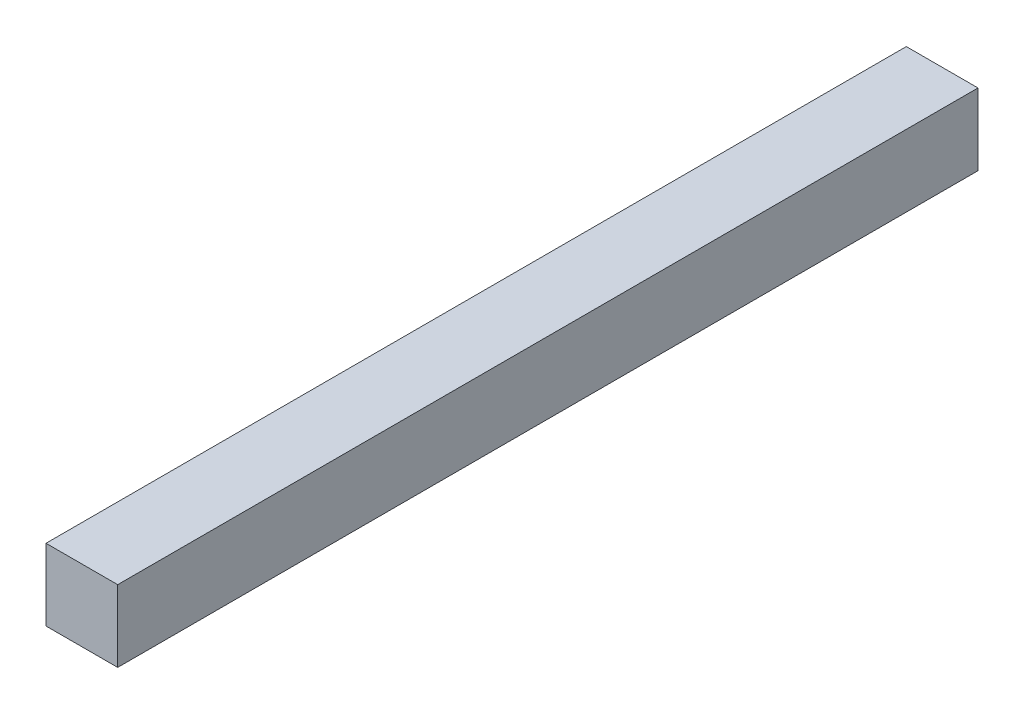
ISO-10303-21;
HEADER;
FILE_DESCRIPTION(('STEP AP214'),'2;1');
FILE_NAME('part.step','',(''),(''),'','','');
FILE_SCHEMA(('AUTOMOTIVE_DESIGN { 1 0 10303 214 1 1 1 1 }'));
ENDSEC;
DATA;
#1=APPLICATION_CONTEXT('core data for automotive mechanical design processes');
#2=APPLICATION_PROTOCOL_DEFINITION('international standard','automotive_design',2000,#1);
#3=PRODUCT_CONTEXT('',#1,'mechanical');
#4=PRODUCT('Part','Part','',(#3));
#5=PRODUCT_RELATED_PRODUCT_CATEGORY('part','',(#4));
#6=PRODUCT_DEFINITION_FORMATION('','',#4);
#7=PRODUCT_DEFINITION_CONTEXT('part definition',#1,'design');
#8=PRODUCT_DEFINITION('design','',#6,#7);
#9=PRODUCT_DEFINITION_SHAPE('','',#8);
#10=(LENGTH_UNIT() NAMED_UNIT(*) SI_UNIT(.MILLI.,.METRE.));
#11=(NAMED_UNIT(*) PLANE_ANGLE_UNIT() SI_UNIT($,.RADIAN.));
#12=(NAMED_UNIT(*) SI_UNIT($,.STERADIAN.) SOLID_ANGLE_UNIT());
#13=UNCERTAINTY_MEASURE_WITH_UNIT(LENGTH_MEASURE(1.E-05),#10,'distance_accuracy_value','');
#14=(GEOMETRIC_REPRESENTATION_CONTEXT(3) GLOBAL_UNCERTAINTY_ASSIGNED_CONTEXT((#13)) GLOBAL_UNIT_ASSIGNED_CONTEXT((#10,
#11,#12)) REPRESENTATION_CONTEXT('',''));
#15=CARTESIAN_POINT('',(0.,0.,0.));
#16=DIRECTION('',(0.,0.,1.));
#17=DIRECTION('',(1.,0.,0.));
#18=AXIS2_PLACEMENT_3D('',#15,#16,#17);
#19=CARTESIAN_POINT('',(-143.285485096681,61.1538461538462,600.));
#20=DIRECTION('',(0.,1.,0.));
#21=DIRECTION('',(0.,0.,1.));
#22=AXIS2_PLACEMENT_3D('',#19,#20,#21);
#23=PLANE('',#22);
#24=DIRECTION('',(1.,0.,0.));
#25=VECTOR('',#24,1.);
#26=CARTESIAN_POINT('',(-143.285485096681,61.1538461538462,0.));
#27=LINE('',#26,#25);
#28=CARTESIAN_POINT('',(-143.285485096681,61.1538461538462,0.));
#29=VERTEX_POINT('',#28);
#30=CARTESIAN_POINT('',(-93.2854850966815,61.1538461538462,0.));
#31=VERTEX_POINT('',#30);
#32=EDGE_CURVE('E110',#29,#31,#27,.T.);
#33=ORIENTED_EDGE('',*,*,#32,.F.);
#34=DIRECTION('',(0.,0.,-1.));
#35=VECTOR('',#34,1.);
#36=CARTESIAN_POINT('',(-143.285485096681,61.1538461538462,600.));
#37=LINE('',#36,#35);
#38=CARTESIAN_POINT('',(-143.285485096681,61.1538461538462,600.));
#39=VERTEX_POINT('',#38);
#40=EDGE_CURVE('E11',#39,#29,#37,.T.);
#41=ORIENTED_EDGE('',*,*,#40,.F.);
#42=DIRECTION('',(1.,0.,0.));
#43=VECTOR('',#42,1.);
#44=CARTESIAN_POINT('',(-143.285485096681,61.1538461538462,600.));
#45=LINE('',#44,#43);
#46=CARTESIAN_POINT('',(-93.2854850966815,61.1538461538462,600.));
#47=VERTEX_POINT('',#46);
#48=EDGE_CURVE('E103',#39,#47,#45,.T.);
#49=ORIENTED_EDGE('',*,*,#48,.T.);
#50=DIRECTION('',(0.,0.,-1.));
#51=VECTOR('',#50,1.);
#52=CARTESIAN_POINT('',(-93.2854850966815,61.1538461538462,600.));
#53=LINE('',#52,#51);
#54=EDGE_CURVE('E42',#47,#31,#53,.T.);
#55=ORIENTED_EDGE('',*,*,#54,.T.);
#56=EDGE_LOOP('',(#33,#41,#49,#55));
#57=FACE_BOUND('',#56,.T.);
#58=ADVANCED_FACE('F39',(#57),#23,.T.);
#59=CARTESIAN_POINT('',(-143.285485096681,61.1538461538462,600.));
#60=DIRECTION('',(1.,0.,0.));
#61=DIRECTION('',(0.,0.,-1.));
#62=AXIS2_PLACEMENT_3D('',#59,#60,#61);
#63=PLANE('',#62);
#64=DIRECTION('',(0.,-1.,0.));
#65=VECTOR('',#64,1.);
#66=CARTESIAN_POINT('',(-143.285485096681,61.1538461538462,0.));
#67=LINE('',#66,#65);
#68=CARTESIAN_POINT('',(-143.285485096681,11.1538461538462,0.));
#69=VERTEX_POINT('',#68);
#70=EDGE_CURVE('E73',#29,#69,#67,.T.);
#71=ORIENTED_EDGE('',*,*,#70,.T.);
#72=DIRECTION('',(0.,0.,-1.));
#73=VECTOR('',#72,1.);
#74=CARTESIAN_POINT('',(-143.285485096681,11.1538461538462,600.));
#75=LINE('',#74,#73);
#76=CARTESIAN_POINT('',(-143.285485096681,11.1538461538462,600.));
#77=VERTEX_POINT('',#76);
#78=EDGE_CURVE('E49',#77,#69,#75,.T.);
#79=ORIENTED_EDGE('',*,*,#78,.F.);
#80=DIRECTION('',(0.,-1.,0.));
#81=VECTOR('',#80,1.);
#82=CARTESIAN_POINT('',(-143.285485096681,61.1538461538462,600.));
#83=LINE('',#82,#81);
#84=EDGE_CURVE('E90',#39,#77,#83,.T.);
#85=ORIENTED_EDGE('',*,*,#84,.F.);
#86=ORIENTED_EDGE('',*,*,#40,.T.);
#87=EDGE_LOOP('',(#71,#79,#85,#86));
#88=FACE_BOUND('',#87,.T.);
#89=ADVANCED_FACE('F126',(#88),#63,.F.);
#90=CARTESIAN_POINT('',(-143.285485096681,11.1538461538462,600.));
#91=DIRECTION('',(0.,1.,0.));
#92=DIRECTION('',(-1.,0.,0.));
#93=AXIS2_PLACEMENT_3D('',#90,#91,#92);
#94=PLANE('',#93);
#95=DIRECTION('',(1.,0.,0.));
#96=VECTOR('',#95,1.);
#97=CARTESIAN_POINT('',(-143.285485096681,11.1538461538462,0.));
#98=LINE('',#97,#96);
#99=CARTESIAN_POINT('',(-93.2854850966815,11.1538461538462,0.));
#100=VERTEX_POINT('',#99);
#101=EDGE_CURVE('E98',#69,#100,#98,.T.);
#102=ORIENTED_EDGE('',*,*,#101,.T.);
#103=DIRECTION('',(0.,0.,-1.));
#104=VECTOR('',#103,1.);
#105=CARTESIAN_POINT('',(-93.2854850966815,11.1538461538462,600.));
#106=LINE('',#105,#104);
#107=CARTESIAN_POINT('',(-93.2854850966815,11.1538461538462,600.));
#108=VERTEX_POINT('',#107);
#109=EDGE_CURVE('E95',#108,#100,#106,.T.);
#110=ORIENTED_EDGE('',*,*,#109,.F.);
#111=DIRECTION('',(1.,0.,0.));
#112=VECTOR('',#111,1.);
#113=CARTESIAN_POINT('',(-143.285485096681,11.1538461538462,600.));
#114=LINE('',#113,#112);
#115=EDGE_CURVE('E85',#77,#108,#114,.T.);
#116=ORIENTED_EDGE('',*,*,#115,.F.);
#117=ORIENTED_EDGE('',*,*,#78,.T.);
#118=EDGE_LOOP('',(#102,#110,#116,#117));
#119=FACE_BOUND('',#118,.T.);
#120=ADVANCED_FACE('F96',(#119),#94,.F.);
#121=CARTESIAN_POINT('',(-93.2854850966815,61.1538461538462,600.));
#122=DIRECTION('',(1.,0.,0.));
#123=DIRECTION('',(0.,0.,-1.));
#124=AXIS2_PLACEMENT_3D('',#121,#122,#123);
#125=PLANE('',#124);
#126=DIRECTION('',(0.,-1.,0.));
#127=VECTOR('',#126,1.);
#128=CARTESIAN_POINT('',(-93.2854850966815,61.1538461538462,0.));
#129=LINE('',#128,#127);
#130=EDGE_CURVE('E114',#31,#100,#129,.T.);
#131=ORIENTED_EDGE('',*,*,#130,.F.);
#132=ORIENTED_EDGE('',*,*,#54,.F.);
#133=DIRECTION('',(0.,-1.,0.));
#134=VECTOR('',#133,1.);
#135=CARTESIAN_POINT('',(-93.2854850966815,61.1538461538462,600.));
#136=LINE('',#135,#134);
#137=EDGE_CURVE('E89',#47,#108,#136,.T.);
#138=ORIENTED_EDGE('',*,*,#137,.T.);
#139=ORIENTED_EDGE('',*,*,#109,.T.);
#140=EDGE_LOOP('',(#131,#132,#138,#139));
#141=FACE_BOUND('',#140,.T.);
#142=ADVANCED_FACE('F101',(#141),#125,.T.);
#143=CARTESIAN_POINT('',(0.,0.,600.));
#144=DIRECTION('',(0.,0.,-1.));
#145=DIRECTION('',(-1.,0.,0.));
#146=AXIS2_PLACEMENT_3D('',#143,#144,#145);
#147=PLANE('',#146);
#148=ORIENTED_EDGE('',*,*,#48,.F.);
#149=ORIENTED_EDGE('',*,*,#84,.T.);
#150=ORIENTED_EDGE('',*,*,#115,.T.);
#151=ORIENTED_EDGE('',*,*,#137,.F.);
#152=EDGE_LOOP('',(#148,#149,#150,#151));
#153=FACE_BOUND('',#152,.T.);
#154=ADVANCED_FACE('F88',(#153),#147,.F.);
#155=CARTESIAN_POINT('',(0.,0.,0.));
#156=DIRECTION('',(0.,0.,-1.));
#157=DIRECTION('',(-1.,0.,0.));
#158=AXIS2_PLACEMENT_3D('',#155,#156,#157);
#159=PLANE('',#158);
#160=ORIENTED_EDGE('',*,*,#32,.T.);
#161=ORIENTED_EDGE('',*,*,#130,.T.);
#162=ORIENTED_EDGE('',*,*,#101,.F.);
#163=ORIENTED_EDGE('',*,*,#70,.F.);
#164=EDGE_LOOP('',(#160,#161,#162,#163));
#165=FACE_BOUND('',#164,.T.);
#166=ADVANCED_FACE('F123',(#165),#159,.T.);
#167=CLOSED_SHELL('',(#58,#89,#120,#142,#154,#166));
#168=MANIFOLD_SOLID_BREP('B2',#167);
#169=ADVANCED_BREP_SHAPE_REPRESENTATION('',(#18,#168),#14);
#170=SHAPE_DEFINITION_REPRESENTATION(#9,#169);
ENDSEC;
END-ISO-10303-21;
